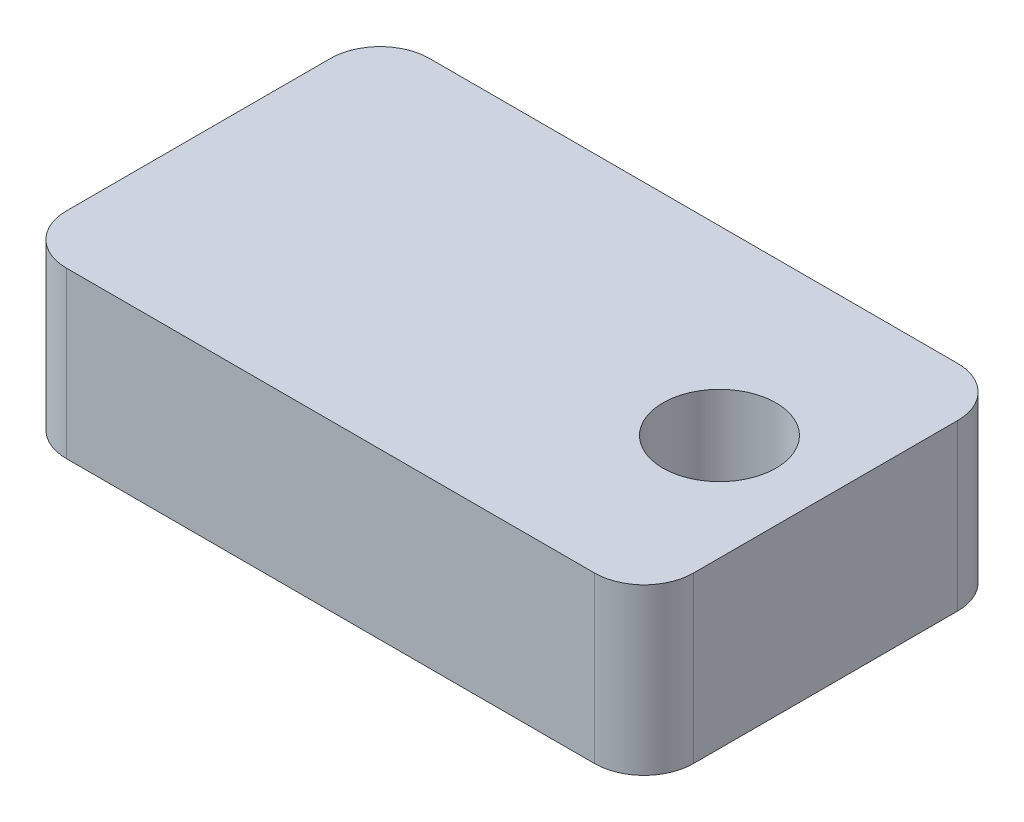
ISO-10303-21;
HEADER;
FILE_DESCRIPTION(('STEP AP214'),'2;1');
FILE_NAME('part.step','',(''),(''),'','','');
FILE_SCHEMA(('AUTOMOTIVE_DESIGN { 1 0 10303 214 1 1 1 1 }'));
ENDSEC;
DATA;
#1=APPLICATION_CONTEXT('core data for automotive mechanical design processes');
#2=APPLICATION_PROTOCOL_DEFINITION('international standard','automotive_design',2000,#1);
#3=PRODUCT_CONTEXT('',#1,'mechanical');
#4=PRODUCT('Part','Part','',(#3));
#5=PRODUCT_RELATED_PRODUCT_CATEGORY('part','',(#4));
#6=PRODUCT_DEFINITION_FORMATION('','',#4);
#7=PRODUCT_DEFINITION_CONTEXT('part definition',#1,'design');
#8=PRODUCT_DEFINITION('design','',#6,#7);
#9=PRODUCT_DEFINITION_SHAPE('','',#8);
#10=(LENGTH_UNIT() NAMED_UNIT(*) SI_UNIT(.MILLI.,.METRE.));
#11=(NAMED_UNIT(*) PLANE_ANGLE_UNIT() SI_UNIT($,.RADIAN.));
#12=(NAMED_UNIT(*) SI_UNIT($,.STERADIAN.) SOLID_ANGLE_UNIT());
#13=UNCERTAINTY_MEASURE_WITH_UNIT(LENGTH_MEASURE(1.E-05),#10,'distance_accuracy_value','');
#14=(GEOMETRIC_REPRESENTATION_CONTEXT(3) GLOBAL_UNCERTAINTY_ASSIGNED_CONTEXT((#13)) GLOBAL_UNIT_ASSIGNED_CONTEXT((#10,
#11,#12)) REPRESENTATION_CONTEXT('',''));
#15=CARTESIAN_POINT('',(0.,0.,0.));
#16=DIRECTION('',(0.,0.,1.));
#17=DIRECTION('',(1.,0.,0.));
#18=AXIS2_PLACEMENT_3D('',#15,#16,#17);
#19=CARTESIAN_POINT('',(0.,10.,0.));
#20=DIRECTION('',(0.,1.,0.));
#21=DIRECTION('',(0.,0.,1.));
#22=AXIS2_PLACEMENT_3D('',#19,#20,#21);
#23=PLANE('',#22);
#24=DIRECTION('',(-1.,0.,0.));
#25=VECTOR('',#24,1.);
#26=CARTESIAN_POINT('',(-19.,10.,-11.));
#27=LINE('',#26,#25);
#28=CARTESIAN_POINT('',(16.,10.,-11.));
#29=VERTEX_POINT('',#28);
#30=CARTESIAN_POINT('',(-16.,10.,-11.));
#31=VERTEX_POINT('',#30);
#32=EDGE_CURVE('E199',#29,#31,#27,.T.);
#33=ORIENTED_EDGE('',*,*,#32,.T.);
#34=CARTESIAN_POINT('',(-16.,10.,-8.));
#35=DIRECTION('',(0.,1.,0.));
#36=DIRECTION('',(0.,0.,1.));
#37=AXIS2_PLACEMENT_3D('',#34,#35,#36);
#38=CIRCLE('',#37,3.);
#39=CARTESIAN_POINT('',(-19.,10.,-8.));
#40=VERTEX_POINT('',#39);
#41=EDGE_CURVE('E172',#31,#40,#38,.T.);
#42=ORIENTED_EDGE('',*,*,#41,.T.);
#43=DIRECTION('',(0.,0.,1.));
#44=VECTOR('',#43,1.);
#45=CARTESIAN_POINT('',(-19.,10.,-11.));
#46=LINE('',#45,#44);
#47=CARTESIAN_POINT('',(-19.,10.,8.));
#48=VERTEX_POINT('',#47);
#49=EDGE_CURVE('E129',#40,#48,#46,.T.);
#50=ORIENTED_EDGE('',*,*,#49,.T.);
#51=CARTESIAN_POINT('',(-16.,10.,8.));
#52=DIRECTION('',(0.,1.,0.));
#53=DIRECTION('',(0.,0.,1.));
#54=AXIS2_PLACEMENT_3D('',#51,#52,#53);
#55=CIRCLE('',#54,3.);
#56=CARTESIAN_POINT('',(-16.,10.,11.));
#57=VERTEX_POINT('',#56);
#58=EDGE_CURVE('E64',#48,#57,#55,.T.);
#59=ORIENTED_EDGE('',*,*,#58,.T.);
#60=DIRECTION('',(1.,0.,0.));
#61=VECTOR('',#60,1.);
#62=CARTESIAN_POINT('',(-19.,10.,11.));
#63=LINE('',#62,#61);
#64=CARTESIAN_POINT('',(16.,10.,11.));
#65=VERTEX_POINT('',#64);
#66=EDGE_CURVE('E150',#57,#65,#63,.T.);
#67=ORIENTED_EDGE('',*,*,#66,.T.);
#68=CARTESIAN_POINT('',(16.,10.,8.));
#69=DIRECTION('',(0.,1.,0.));
#70=DIRECTION('',(0.,0.,1.));
#71=AXIS2_PLACEMENT_3D('',#68,#69,#70);
#72=CIRCLE('',#71,3.);
#73=CARTESIAN_POINT('',(19.,10.,8.));
#74=VERTEX_POINT('',#73);
#75=EDGE_CURVE('E166',#65,#74,#72,.T.);
#76=ORIENTED_EDGE('',*,*,#75,.T.);
#77=DIRECTION('',(0.,0.,-1.));
#78=VECTOR('',#77,1.);
#79=CARTESIAN_POINT('',(19.,10.,-11.));
#80=LINE('',#79,#78);
#81=CARTESIAN_POINT('',(19.,10.,-8.));
#82=VERTEX_POINT('',#81);
#83=EDGE_CURVE('E143',#74,#82,#80,.T.);
#84=ORIENTED_EDGE('',*,*,#83,.T.);
#85=CARTESIAN_POINT('',(16.,10.,-8.));
#86=DIRECTION('',(0.,1.,0.));
#87=DIRECTION('',(0.,0.,1.));
#88=AXIS2_PLACEMENT_3D('',#85,#86,#87);
#89=CIRCLE('',#88,3.);
#90=EDGE_CURVE('E169',#82,#29,#89,.T.);
#91=ORIENTED_EDGE('',*,*,#90,.T.);
#92=EDGE_LOOP('',(#33,#42,#50,#59,#67,#76,#84,#91));
#93=FACE_BOUND('',#92,.T.);
#94=CARTESIAN_POINT('',(12.571,10.,0.));
#95=DIRECTION('',(0.,1.,0.));
#96=DIRECTION('',(0.,0.,1.));
#97=AXIS2_PLACEMENT_3D('',#94,#95,#96);
#98=CIRCLE('',#97,3.429);
#99=CARTESIAN_POINT('',(12.571,10.,3.429));
#100=VERTEX_POINT('',#99);
#101=EDGE_CURVE('E212',#100,#100,#98,.T.);
#102=ORIENTED_EDGE('',*,*,#101,.F.);
#103=EDGE_LOOP('',(#102));
#104=FACE_BOUND('',#103,.T.);
#105=ADVANCED_FACE('F43',(#93,#104),#23,.T.);
#106=CARTESIAN_POINT('',(0.,0.,0.));
#107=DIRECTION('',(0.,1.,0.));
#108=DIRECTION('',(0.,0.,1.));
#109=AXIS2_PLACEMENT_3D('',#106,#107,#108);
#110=PLANE('',#109);
#111=DIRECTION('',(0.,0.,1.));
#112=VECTOR('',#111,1.);
#113=CARTESIAN_POINT('',(-19.,0.,-11.));
#114=LINE('',#113,#112);
#115=CARTESIAN_POINT('',(-19.,0.,-8.));
#116=VERTEX_POINT('',#115);
#117=CARTESIAN_POINT('',(-19.,0.,8.));
#118=VERTEX_POINT('',#117);
#119=EDGE_CURVE('E127',#116,#118,#114,.T.);
#120=ORIENTED_EDGE('',*,*,#119,.F.);
#121=CARTESIAN_POINT('',(-16.,0.,-8.));
#122=DIRECTION('',(0.,1.,0.));
#123=DIRECTION('',(0.,0.,1.));
#124=AXIS2_PLACEMENT_3D('',#121,#122,#123);
#125=CIRCLE('',#124,3.);
#126=CARTESIAN_POINT('',(-16.,0.,-11.));
#127=VERTEX_POINT('',#126);
#128=EDGE_CURVE('E109',#116,#127,#125,.F.);
#129=ORIENTED_EDGE('',*,*,#128,.T.);
#130=DIRECTION('',(-1.,0.,0.));
#131=VECTOR('',#130,1.);
#132=CARTESIAN_POINT('',(-19.,0.,-11.));
#133=LINE('',#132,#131);
#134=CARTESIAN_POINT('',(16.,0.,-11.));
#135=VERTEX_POINT('',#134);
#136=EDGE_CURVE('E139',#135,#127,#133,.T.);
#137=ORIENTED_EDGE('',*,*,#136,.F.);
#138=CARTESIAN_POINT('',(16.,0.,-8.));
#139=DIRECTION('',(0.,1.,0.));
#140=DIRECTION('',(0.,0.,1.));
#141=AXIS2_PLACEMENT_3D('',#138,#139,#140);
#142=CIRCLE('',#141,3.);
#143=CARTESIAN_POINT('',(19.,0.,-8.));
#144=VERTEX_POINT('',#143);
#145=EDGE_CURVE('E121',#135,#144,#142,.F.);
#146=ORIENTED_EDGE('',*,*,#145,.T.);
#147=DIRECTION('',(0.,0.,-1.));
#148=VECTOR('',#147,1.);
#149=CARTESIAN_POINT('',(19.,0.,-11.));
#150=LINE('',#149,#148);
#151=CARTESIAN_POINT('',(19.,0.,8.));
#152=VERTEX_POINT('',#151);
#153=EDGE_CURVE('E145',#152,#144,#150,.T.);
#154=ORIENTED_EDGE('',*,*,#153,.F.);
#155=CARTESIAN_POINT('',(16.,0.,8.));
#156=DIRECTION('',(0.,1.,0.));
#157=DIRECTION('',(0.,0.,1.));
#158=AXIS2_PLACEMENT_3D('',#155,#156,#157);
#159=CIRCLE('',#158,3.);
#160=CARTESIAN_POINT('',(16.,0.,11.));
#161=VERTEX_POINT('',#160);
#162=EDGE_CURVE('E154',#152,#161,#159,.F.);
#163=ORIENTED_EDGE('',*,*,#162,.T.);
#164=DIRECTION('',(1.,0.,0.));
#165=VECTOR('',#164,1.);
#166=CARTESIAN_POINT('',(-19.,0.,11.));
#167=LINE('',#166,#165);
#168=CARTESIAN_POINT('',(-16.,0.,11.));
#169=VERTEX_POINT('',#168);
#170=EDGE_CURVE('E138',#169,#161,#167,.T.);
#171=ORIENTED_EDGE('',*,*,#170,.F.);
#172=CARTESIAN_POINT('',(-16.,0.,8.));
#173=DIRECTION('',(0.,1.,0.));
#174=DIRECTION('',(0.,0.,1.));
#175=AXIS2_PLACEMENT_3D('',#172,#173,#174);
#176=CIRCLE('',#175,3.);
#177=EDGE_CURVE('E131',#169,#118,#176,.F.);
#178=ORIENTED_EDGE('',*,*,#177,.T.);
#179=EDGE_LOOP('',(#120,#129,#137,#146,#154,#163,#171,#178));
#180=FACE_BOUND('',#179,.T.);
#181=CARTESIAN_POINT('',(12.571,0.,0.));
#182=DIRECTION('',(0.,1.,0.));
#183=DIRECTION('',(0.,0.,1.));
#184=AXIS2_PLACEMENT_3D('',#181,#182,#183);
#185=CIRCLE('',#184,3.429);
#186=CARTESIAN_POINT('',(12.571,0.,3.429));
#187=VERTEX_POINT('',#186);
#188=EDGE_CURVE('E205',#187,#187,#185,.T.);
#189=ORIENTED_EDGE('',*,*,#188,.T.);
#190=EDGE_LOOP('',(#189));
#191=FACE_BOUND('',#190,.T.);
#192=ADVANCED_FACE('F134',(#180,#191),#110,.F.);
#193=CARTESIAN_POINT('',(19.,10.,-11.));
#194=DIRECTION('',(-1.,0.,0.));
#195=DIRECTION('',(0.,0.,1.));
#196=AXIS2_PLACEMENT_3D('',#193,#194,#195);
#197=PLANE('',#196);
#198=ORIENTED_EDGE('',*,*,#153,.T.);
#199=DIRECTION('',(0.,-1.,0.));
#200=VECTOR('',#199,1.);
#201=CARTESIAN_POINT('',(19.,10.,-8.));
#202=LINE('',#201,#200);
#203=EDGE_CURVE('E179',#144,#82,#202,.F.);
#204=ORIENTED_EDGE('',*,*,#203,.T.);
#205=ORIENTED_EDGE('',*,*,#83,.F.);
#206=DIRECTION('',(0.,-1.,0.));
#207=VECTOR('',#206,1.);
#208=CARTESIAN_POINT('',(19.,10.,8.));
#209=LINE('',#208,#207);
#210=EDGE_CURVE('E175',#74,#152,#209,.T.);
#211=ORIENTED_EDGE('',*,*,#210,.T.);
#212=EDGE_LOOP('',(#198,#204,#205,#211));
#213=FACE_BOUND('',#212,.T.);
#214=ADVANCED_FACE('F194',(#213),#197,.F.);
#215=CARTESIAN_POINT('',(-19.,10.,-11.));
#216=DIRECTION('',(0.,0.,1.));
#217=DIRECTION('',(1.,0.,0.));
#218=AXIS2_PLACEMENT_3D('',#215,#216,#217);
#219=PLANE('',#218);
#220=ORIENTED_EDGE('',*,*,#136,.T.);
#221=DIRECTION('',(0.,-1.,0.));
#222=VECTOR('',#221,1.);
#223=CARTESIAN_POINT('',(-16.,10.,-11.));
#224=LINE('',#223,#222);
#225=EDGE_CURVE('E114',#127,#31,#224,.F.);
#226=ORIENTED_EDGE('',*,*,#225,.T.);
#227=ORIENTED_EDGE('',*,*,#32,.F.);
#228=DIRECTION('',(0.,-1.,0.));
#229=VECTOR('',#228,1.);
#230=CARTESIAN_POINT('',(16.,10.,-11.));
#231=LINE('',#230,#229);
#232=EDGE_CURVE('E120',#29,#135,#231,.T.);
#233=ORIENTED_EDGE('',*,*,#232,.T.);
#234=EDGE_LOOP('',(#220,#226,#227,#233));
#235=FACE_BOUND('',#234,.T.);
#236=ADVANCED_FACE('F241',(#235),#219,.F.);
#237=CARTESIAN_POINT('',(-19.,10.,-11.));
#238=DIRECTION('',(1.,0.,0.));
#239=DIRECTION('',(0.,0.,-1.));
#240=AXIS2_PLACEMENT_3D('',#237,#238,#239);
#241=PLANE('',#240);
#242=ORIENTED_EDGE('',*,*,#49,.F.);
#243=DIRECTION('',(0.,-1.,0.));
#244=VECTOR('',#243,1.);
#245=CARTESIAN_POINT('',(-19.,10.,-8.));
#246=LINE('',#245,#244);
#247=EDGE_CURVE('E113',#40,#116,#246,.T.);
#248=ORIENTED_EDGE('',*,*,#247,.T.);
#249=ORIENTED_EDGE('',*,*,#119,.T.);
#250=DIRECTION('',(0.,-1.,0.));
#251=VECTOR('',#250,1.);
#252=CARTESIAN_POINT('',(-19.,10.,8.));
#253=LINE('',#252,#251);
#254=EDGE_CURVE('E132',#118,#48,#253,.F.);
#255=ORIENTED_EDGE('',*,*,#254,.T.);
#256=EDGE_LOOP('',(#242,#248,#249,#255));
#257=FACE_BOUND('',#256,.T.);
#258=ADVANCED_FACE('F126',(#257),#241,.F.);
#259=CARTESIAN_POINT('',(-19.,10.,11.));
#260=DIRECTION('',(0.,0.,-1.));
#261=DIRECTION('',(-1.,0.,0.));
#262=AXIS2_PLACEMENT_3D('',#259,#260,#261);
#263=PLANE('',#262);
#264=ORIENTED_EDGE('',*,*,#170,.T.);
#265=DIRECTION('',(0.,-1.,0.));
#266=VECTOR('',#265,1.);
#267=CARTESIAN_POINT('',(16.,10.,11.));
#268=LINE('',#267,#266);
#269=EDGE_CURVE('E11',#161,#65,#268,.F.);
#270=ORIENTED_EDGE('',*,*,#269,.T.);
#271=ORIENTED_EDGE('',*,*,#66,.F.);
#272=DIRECTION('',(0.,-1.,0.));
#273=VECTOR('',#272,1.);
#274=CARTESIAN_POINT('',(-16.,10.,11.));
#275=LINE('',#274,#273);
#276=EDGE_CURVE('E52',#57,#169,#275,.T.);
#277=ORIENTED_EDGE('',*,*,#276,.T.);
#278=EDGE_LOOP('',(#264,#270,#271,#277));
#279=FACE_BOUND('',#278,.T.);
#280=ADVANCED_FACE('F184',(#279),#263,.F.);
#281=CARTESIAN_POINT('',(12.571,10.,0.));
#282=DIRECTION('',(0.,-1.,0.));
#283=DIRECTION('',(0.,0.,-1.));
#284=AXIS2_PLACEMENT_3D('',#281,#282,#283);
#285=CYLINDRICAL_SURFACE('',#284,3.429);
#286=ORIENTED_EDGE('',*,*,#101,.T.);
#287=EDGE_LOOP('',(#286));
#288=FACE_BOUND('',#287,.T.);
#289=ORIENTED_EDGE('',*,*,#188,.F.);
#290=EDGE_LOOP('',(#289));
#291=FACE_BOUND('',#290,.T.);
#292=ADVANCED_FACE('F221',(#288,#291),#285,.F.);
#293=CARTESIAN_POINT('',(-16.,10.,-8.));
#294=DIRECTION('',(0.,-1.,0.));
#295=DIRECTION('',(0.,0.,-1.));
#296=AXIS2_PLACEMENT_3D('',#293,#294,#295);
#297=CYLINDRICAL_SURFACE('',#296,3.);
#298=ORIENTED_EDGE('',*,*,#41,.F.);
#299=ORIENTED_EDGE('',*,*,#225,.F.);
#300=ORIENTED_EDGE('',*,*,#128,.F.);
#301=ORIENTED_EDGE('',*,*,#247,.F.);
#302=EDGE_LOOP('',(#298,#299,#300,#301));
#303=FACE_BOUND('',#302,.T.);
#304=ADVANCED_FACE('F112',(#303),#297,.T.);
#305=CARTESIAN_POINT('',(16.,10.,-8.));
#306=DIRECTION('',(0.,-1.,0.));
#307=DIRECTION('',(0.,0.,-1.));
#308=AXIS2_PLACEMENT_3D('',#305,#306,#307);
#309=CYLINDRICAL_SURFACE('',#308,3.);
#310=ORIENTED_EDGE('',*,*,#90,.F.);
#311=ORIENTED_EDGE('',*,*,#203,.F.);
#312=ORIENTED_EDGE('',*,*,#145,.F.);
#313=ORIENTED_EDGE('',*,*,#232,.F.);
#314=EDGE_LOOP('',(#310,#311,#312,#313));
#315=FACE_BOUND('',#314,.T.);
#316=ADVANCED_FACE('F228',(#315),#309,.T.);
#317=CARTESIAN_POINT('',(16.,10.,8.));
#318=DIRECTION('',(0.,-1.,0.));
#319=DIRECTION('',(0.,0.,-1.));
#320=AXIS2_PLACEMENT_3D('',#317,#318,#319);
#321=CYLINDRICAL_SURFACE('',#320,3.);
#322=ORIENTED_EDGE('',*,*,#75,.F.);
#323=ORIENTED_EDGE('',*,*,#269,.F.);
#324=ORIENTED_EDGE('',*,*,#162,.F.);
#325=ORIENTED_EDGE('',*,*,#210,.F.);
#326=EDGE_LOOP('',(#322,#323,#324,#325));
#327=FACE_BOUND('',#326,.T.);
#328=ADVANCED_FACE('F191',(#327),#321,.T.);
#329=CARTESIAN_POINT('',(-16.,10.,8.));
#330=DIRECTION('',(0.,-1.,0.));
#331=DIRECTION('',(0.,0.,-1.));
#332=AXIS2_PLACEMENT_3D('',#329,#330,#331);
#333=CYLINDRICAL_SURFACE('',#332,3.);
#334=ORIENTED_EDGE('',*,*,#58,.F.);
#335=ORIENTED_EDGE('',*,*,#254,.F.);
#336=ORIENTED_EDGE('',*,*,#177,.F.);
#337=ORIENTED_EDGE('',*,*,#276,.F.);
#338=EDGE_LOOP('',(#334,#335,#336,#337));
#339=FACE_BOUND('',#338,.T.);
#340=ADVANCED_FACE('F45',(#339),#333,.T.);
#341=CLOSED_SHELL('',(#105,#192,#214,#236,#258,#280,#292,#304,#316,#328,#340));
#342=MANIFOLD_SOLID_BREP('B2',#341);
#343=ADVANCED_BREP_SHAPE_REPRESENTATION('',(#18,#342),#14);
#344=SHAPE_DEFINITION_REPRESENTATION(#9,#343);
ENDSEC;
END-ISO-10303-21;
